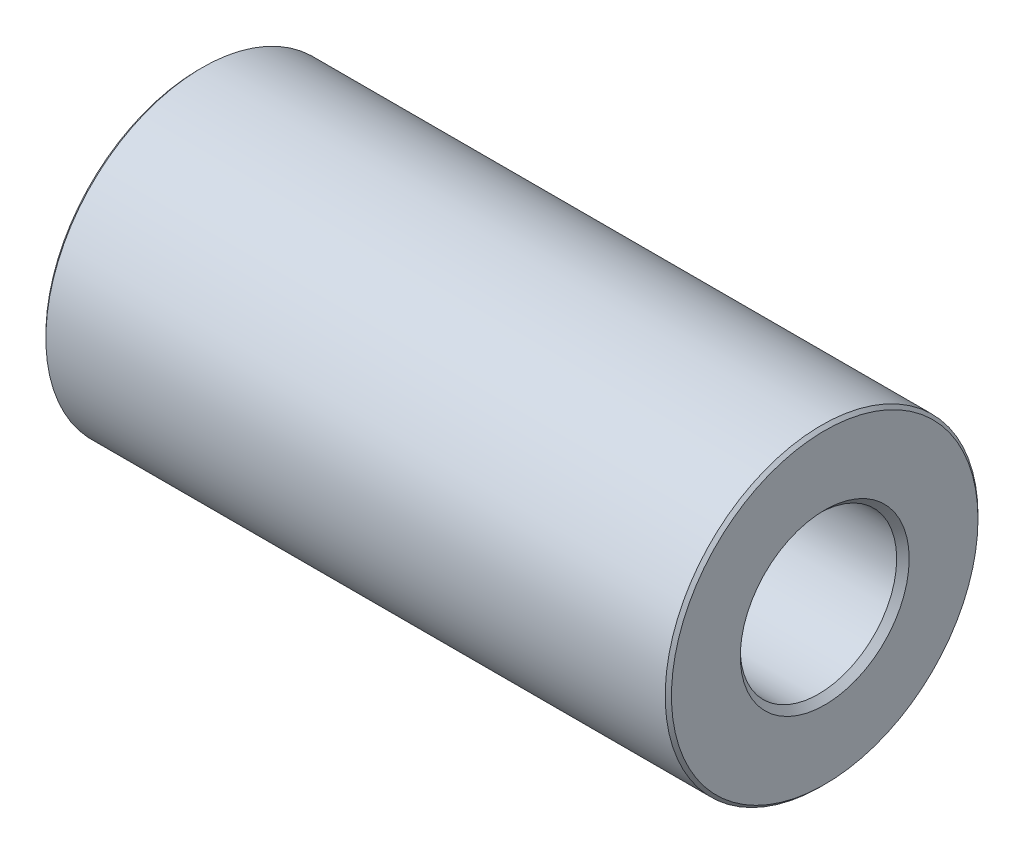
ISO-10303-21;
HEADER;
FILE_DESCRIPTION(('STEP AP214'),'2;1');
FILE_NAME('part.step','',(''),(''),'','','');
FILE_SCHEMA(('AUTOMOTIVE_DESIGN { 1 0 10303 214 1 1 1 1 }'));
ENDSEC;
DATA;
#1=APPLICATION_CONTEXT('core data for automotive mechanical design processes');
#2=APPLICATION_PROTOCOL_DEFINITION('international standard','automotive_design',2000,#1);
#3=PRODUCT_CONTEXT('',#1,'mechanical');
#4=PRODUCT('Part','Part','',(#3));
#5=PRODUCT_RELATED_PRODUCT_CATEGORY('part','',(#4));
#6=PRODUCT_DEFINITION_FORMATION('','',#4);
#7=PRODUCT_DEFINITION_CONTEXT('part definition',#1,'design');
#8=PRODUCT_DEFINITION('design','',#6,#7);
#9=PRODUCT_DEFINITION_SHAPE('','',#8);
#10=(LENGTH_UNIT() NAMED_UNIT(*) SI_UNIT(.MILLI.,.METRE.));
#11=(NAMED_UNIT(*) PLANE_ANGLE_UNIT() SI_UNIT($,.RADIAN.));
#12=(NAMED_UNIT(*) SI_UNIT($,.STERADIAN.) SOLID_ANGLE_UNIT());
#13=UNCERTAINTY_MEASURE_WITH_UNIT(LENGTH_MEASURE(1.E-05),#10,'distance_accuracy_value','');
#14=(GEOMETRIC_REPRESENTATION_CONTEXT(3) GLOBAL_UNCERTAINTY_ASSIGNED_CONTEXT((#13)) GLOBAL_UNIT_ASSIGNED_CONTEXT((#10,
#11,#12)) REPRESENTATION_CONTEXT('',''));
#15=CARTESIAN_POINT('',(0.,0.,0.));
#16=DIRECTION('',(0.,0.,1.));
#17=DIRECTION('',(1.,0.,0.));
#18=AXIS2_PLACEMENT_3D('',#15,#16,#17);
#19=CARTESIAN_POINT('',(10.,0.,0.));
#20=DIRECTION('',(1.,0.,0.));
#21=DIRECTION('',(0.,0.,-1.));
#22=AXIS2_PLACEMENT_3D('',#19,#20,#21);
#23=PLANE('',#22);
#24=CARTESIAN_POINT('',(10.,0.,0.));
#25=DIRECTION('',(1.,0.,0.));
#26=DIRECTION('',(0.,0.,-1.));
#27=AXIS2_PLACEMENT_3D('',#24,#25,#26);
#28=CIRCLE('',#27,2.70000000000001);
#29=CARTESIAN_POINT('',(10.,0.,-2.70000000000001));
#30=VERTEX_POINT('',#29);
#31=EDGE_CURVE('E8',#30,#30,#28,.F.);
#32=ORIENTED_EDGE('',*,*,#31,.T.);
#33=EDGE_LOOP('',(#32));
#34=FACE_BOUND('',#33,.T.);
#35=CARTESIAN_POINT('',(10.,0.,0.));
#36=DIRECTION('',(1.,0.,0.));
#37=DIRECTION('',(0.,0.,-1.));
#38=AXIS2_PLACEMENT_3D('',#35,#36,#37);
#39=CIRCLE('',#38,4.9);
#40=CARTESIAN_POINT('',(10.,0.,-4.9));
#41=VERTEX_POINT('',#40);
#42=EDGE_CURVE('E24',#41,#41,#39,.T.);
#43=ORIENTED_EDGE('',*,*,#42,.T.);
#44=EDGE_LOOP('',(#43));
#45=FACE_BOUND('',#44,.T.);
#46=ADVANCED_FACE('F13',(#34,#45),#23,.T.);
#47=CARTESIAN_POINT('',(-10.,0.,0.));
#48=DIRECTION('',(1.,0.,0.));
#49=DIRECTION('',(0.,0.,-1.));
#50=AXIS2_PLACEMENT_3D('',#47,#48,#49);
#51=PLANE('',#50);
#52=CARTESIAN_POINT('',(-10.,0.,0.));
#53=DIRECTION('',(1.,0.,0.));
#54=DIRECTION('',(0.,0.,-1.));
#55=AXIS2_PLACEMENT_3D('',#52,#53,#54);
#56=CIRCLE('',#55,2.6);
#57=CARTESIAN_POINT('',(-10.,0.,-2.6));
#58=VERTEX_POINT('',#57);
#59=EDGE_CURVE('E39',#58,#58,#56,.T.);
#60=ORIENTED_EDGE('',*,*,#59,.T.);
#61=EDGE_LOOP('',(#60));
#62=FACE_BOUND('',#61,.T.);
#63=CARTESIAN_POINT('',(-10.,0.,0.));
#64=DIRECTION('',(1.,0.,0.));
#65=DIRECTION('',(0.,0.,-1.));
#66=AXIS2_PLACEMENT_3D('',#63,#64,#65);
#67=CIRCLE('',#66,4.9);
#68=CARTESIAN_POINT('',(-10.,0.,-4.9));
#69=VERTEX_POINT('',#68);
#70=EDGE_CURVE('E42',#69,#69,#67,.F.);
#71=ORIENTED_EDGE('',*,*,#70,.T.);
#72=EDGE_LOOP('',(#71));
#73=FACE_BOUND('',#72,.T.);
#74=ADVANCED_FACE('F46',(#62,#73),#51,.F.);
#75=CARTESIAN_POINT('',(10.,0.,0.));
#76=DIRECTION('',(-1.,0.,0.));
#77=DIRECTION('',(0.,0.,1.));
#78=AXIS2_PLACEMENT_3D('',#75,#76,#77);
#79=CYLINDRICAL_SURFACE('',#78,5.);
#80=CARTESIAN_POINT('',(-9.9,0.,0.));
#81=DIRECTION('',(1.,0.,0.));
#82=DIRECTION('',(0.,0.,-1.));
#83=AXIS2_PLACEMENT_3D('',#80,#81,#82);
#84=CIRCLE('',#83,5.);
#85=CARTESIAN_POINT('',(-9.9,0.,-5.));
#86=VERTEX_POINT('',#85);
#87=EDGE_CURVE('E28',#86,#86,#84,.T.);
#88=ORIENTED_EDGE('',*,*,#87,.T.);
#89=EDGE_LOOP('',(#88));
#90=FACE_BOUND('',#89,.T.);
#91=CARTESIAN_POINT('',(9.90000000000001,0.,0.));
#92=DIRECTION('',(1.,0.,0.));
#93=DIRECTION('',(0.,0.,-1.));
#94=AXIS2_PLACEMENT_3D('',#91,#92,#93);
#95=CIRCLE('',#94,5.);
#96=CARTESIAN_POINT('',(9.90000000000001,0.,-5.));
#97=VERTEX_POINT('',#96);
#98=EDGE_CURVE('E33',#97,#97,#95,.F.);
#99=ORIENTED_EDGE('',*,*,#98,.T.);
#100=EDGE_LOOP('',(#99));
#101=FACE_BOUND('',#100,.T.);
#102=ADVANCED_FACE('F56',(#90,#101),#79,.T.);
#103=CARTESIAN_POINT('',(10.,0.,0.));
#104=DIRECTION('',(-1.,0.,0.));
#105=DIRECTION('',(0.,0.,1.));
#106=AXIS2_PLACEMENT_3D('',#103,#104,#105);
#107=CYLINDRICAL_SURFACE('',#106,2.5);
#108=CARTESIAN_POINT('',(9.79999999999999,0.,0.));
#109=DIRECTION('',(1.,0.,0.));
#110=DIRECTION('',(0.,0.,-1.));
#111=AXIS2_PLACEMENT_3D('',#108,#109,#110);
#112=CIRCLE('',#111,2.5);
#113=CARTESIAN_POINT('',(9.79999999999999,0.,-2.5));
#114=VERTEX_POINT('',#113);
#115=EDGE_CURVE('E20',#114,#114,#112,.T.);
#116=ORIENTED_EDGE('',*,*,#115,.T.);
#117=EDGE_LOOP('',(#116));
#118=FACE_BOUND('',#117,.T.);
#119=CARTESIAN_POINT('',(-9.9,0.,0.));
#120=DIRECTION('',(1.,0.,0.));
#121=DIRECTION('',(0.,0.,-1.));
#122=AXIS2_PLACEMENT_3D('',#119,#120,#121);
#123=CIRCLE('',#122,2.5);
#124=CARTESIAN_POINT('',(-9.9,0.,-2.5));
#125=VERTEX_POINT('',#124);
#126=EDGE_CURVE('E36',#125,#125,#123,.F.);
#127=ORIENTED_EDGE('',*,*,#126,.T.);
#128=EDGE_LOOP('',(#127));
#129=FACE_BOUND('',#128,.T.);
#130=ADVANCED_FACE('F59',(#118,#129),#107,.F.);
#131=CARTESIAN_POINT('',(-10.,0.,0.));
#132=DIRECTION('',(-1.,0.,0.));
#133=DIRECTION('',(0.,0.,1.));
#134=AXIS2_PLACEMENT_3D('',#131,#132,#133);
#135=CONICAL_SURFACE('',#134,2.6,0.785398163397442);
#136=ORIENTED_EDGE('',*,*,#126,.F.);
#137=EDGE_LOOP('',(#136));
#138=FACE_BOUND('',#137,.T.);
#139=ORIENTED_EDGE('',*,*,#59,.F.);
#140=EDGE_LOOP('',(#139));
#141=FACE_BOUND('',#140,.T.);
#142=ADVANCED_FACE('F52',(#138,#141),#135,.F.);
#143=CARTESIAN_POINT('',(-9.9,0.,0.));
#144=DIRECTION('',(1.,0.,0.));
#145=DIRECTION('',(0.,0.,-1.));
#146=AXIS2_PLACEMENT_3D('',#143,#144,#145);
#147=CONICAL_SURFACE('',#146,5.,0.785398163397461);
#148=ORIENTED_EDGE('',*,*,#70,.F.);
#149=EDGE_LOOP('',(#148));
#150=FACE_BOUND('',#149,.T.);
#151=ORIENTED_EDGE('',*,*,#87,.F.);
#152=EDGE_LOOP('',(#151));
#153=FACE_BOUND('',#152,.T.);
#154=ADVANCED_FACE('F48',(#150,#153),#147,.T.);
#155=CARTESIAN_POINT('',(10.,0.,0.));
#156=DIRECTION('',(-1.,0.,0.));
#157=DIRECTION('',(0.,0.,1.));
#158=AXIS2_PLACEMENT_3D('',#155,#156,#157);
#159=CONICAL_SURFACE('',#158,4.9,0.785398163397453);
#160=ORIENTED_EDGE('',*,*,#98,.F.);
#161=EDGE_LOOP('',(#160));
#162=FACE_BOUND('',#161,.T.);
#163=ORIENTED_EDGE('',*,*,#42,.F.);
#164=EDGE_LOOP('',(#163));
#165=FACE_BOUND('',#164,.T.);
#166=ADVANCED_FACE('F51',(#162,#165),#159,.T.);
#167=CARTESIAN_POINT('',(9.79999999999999,0.,0.));
#168=DIRECTION('',(1.,0.,0.));
#169=DIRECTION('',(0.,0.,-1.));
#170=AXIS2_PLACEMENT_3D('',#167,#168,#169);
#171=CONICAL_SURFACE('',#170,2.5,0.785398163397454);
#172=ORIENTED_EDGE('',*,*,#31,.F.);
#173=EDGE_LOOP('',(#172));
#174=FACE_BOUND('',#173,.T.);
#175=ORIENTED_EDGE('',*,*,#115,.F.);
#176=EDGE_LOOP('',(#175));
#177=FACE_BOUND('',#176,.T.);
#178=ADVANCED_FACE('F15',(#174,#177),#171,.F.);
#179=CLOSED_SHELL('',(#46,#74,#102,#130,#142,#154,#166,#178));
#180=MANIFOLD_SOLID_BREP('B1',#179);
#181=ADVANCED_BREP_SHAPE_REPRESENTATION('',(#18,#180),#14);
#182=SHAPE_DEFINITION_REPRESENTATION(#9,#181);
ENDSEC;
END-ISO-10303-21;
